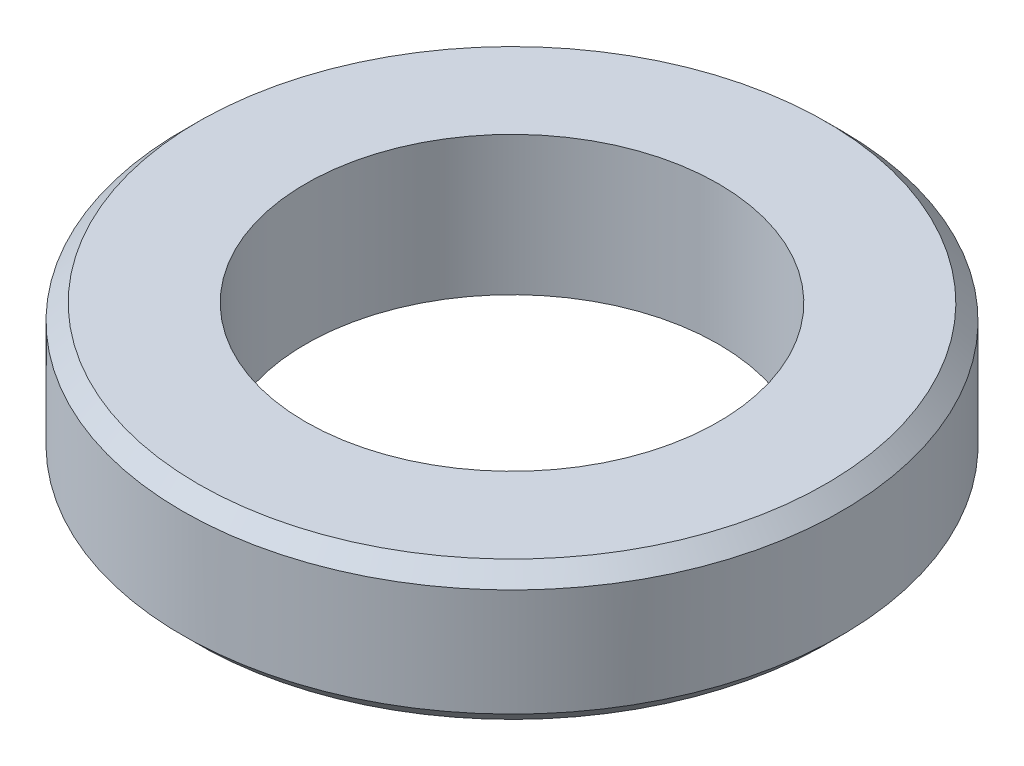
ISO-10303-21;
HEADER;
FILE_DESCRIPTION(('STEP AP214'),'2;1');
FILE_NAME('part.step','',(''),(''),'','','');
FILE_SCHEMA(('AUTOMOTIVE_DESIGN { 1 0 10303 214 1 1 1 1 }'));
ENDSEC;
DATA;
#1=APPLICATION_CONTEXT('core data for automotive mechanical design processes');
#2=APPLICATION_PROTOCOL_DEFINITION('international standard','automotive_design',2000,#1);
#3=PRODUCT_CONTEXT('',#1,'mechanical');
#4=PRODUCT('Part','Part','',(#3));
#5=PRODUCT_RELATED_PRODUCT_CATEGORY('part','',(#4));
#6=PRODUCT_DEFINITION_FORMATION('','',#4);
#7=PRODUCT_DEFINITION_CONTEXT('part definition',#1,'design');
#8=PRODUCT_DEFINITION('design','',#6,#7);
#9=PRODUCT_DEFINITION_SHAPE('','',#8);
#10=(LENGTH_UNIT() NAMED_UNIT(*) SI_UNIT(.MILLI.,.METRE.));
#11=(NAMED_UNIT(*) PLANE_ANGLE_UNIT() SI_UNIT($,.RADIAN.));
#12=(NAMED_UNIT(*) SI_UNIT($,.STERADIAN.) SOLID_ANGLE_UNIT());
#13=UNCERTAINTY_MEASURE_WITH_UNIT(LENGTH_MEASURE(1.E-05),#10,'distance_accuracy_value','');
#14=(GEOMETRIC_REPRESENTATION_CONTEXT(3) GLOBAL_UNCERTAINTY_ASSIGNED_CONTEXT((#13)) GLOBAL_UNIT_ASSIGNED_CONTEXT((#10,
#11,#12)) REPRESENTATION_CONTEXT('',''));
#15=CARTESIAN_POINT('',(0.,0.,0.));
#16=DIRECTION('',(0.,0.,1.));
#17=DIRECTION('',(1.,0.,0.));
#18=AXIS2_PLACEMENT_3D('',#15,#16,#17);
#19=CARTESIAN_POINT('',(0.,0.,0.));
#20=DIRECTION('',(0.,-1.,0.));
#21=DIRECTION('',(0.,0.,-1.));
#22=AXIS2_PLACEMENT_3D('',#19,#20,#21);
#23=CYLINDRICAL_SURFACE('',#22,10.668);
#24=CARTESIAN_POINT('',(0.,-3.98779999999999,0.));
#25=DIRECTION('',(0.,-1.,0.));
#26=DIRECTION('',(0.,0.,-1.));
#27=AXIS2_PLACEMENT_3D('',#24,#25,#26);
#28=CIRCLE('',#27,10.668);
#29=CARTESIAN_POINT('',(0.,-3.98779999999999,-10.668));
#30=VERTEX_POINT('',#29);
#31=EDGE_CURVE('E39',#30,#30,#28,.F.);
#32=ORIENTED_EDGE('',*,*,#31,.T.);
#33=EDGE_LOOP('',(#32));
#34=FACE_BOUND('',#33,.T.);
#35=CARTESIAN_POINT('',(0.,-0.508,0.));
#36=DIRECTION('',(0.,1.,0.));
#37=DIRECTION('',(0.,0.,1.));
#38=AXIS2_PLACEMENT_3D('',#35,#36,#37);
#39=CIRCLE('',#38,10.668);
#40=CARTESIAN_POINT('',(0.,-0.508,10.668));
#41=VERTEX_POINT('',#40);
#42=EDGE_CURVE('E43',#41,#41,#39,.F.);
#43=ORIENTED_EDGE('',*,*,#42,.T.);
#44=EDGE_LOOP('',(#43));
#45=FACE_BOUND('',#44,.T.);
#46=ADVANCED_FACE('F32',(#34,#45),#23,.T.);
#47=CARTESIAN_POINT('',(10.668,0.,0.));
#48=DIRECTION('',(0.,1.,0.));
#49=DIRECTION('',(0.,0.,1.));
#50=AXIS2_PLACEMENT_3D('',#47,#48,#49);
#51=PLANE('',#50);
#52=CARTESIAN_POINT('',(0.,0.,0.));
#53=DIRECTION('',(0.,1.,0.));
#54=DIRECTION('',(0.,0.,1.));
#55=AXIS2_PLACEMENT_3D('',#52,#53,#54);
#56=CIRCLE('',#55,10.16);
#57=CARTESIAN_POINT('',(0.,0.,10.16));
#58=VERTEX_POINT('',#57);
#59=EDGE_CURVE('E10',#58,#58,#56,.T.);
#60=ORIENTED_EDGE('',*,*,#59,.T.);
#61=EDGE_LOOP('',(#60));
#62=FACE_BOUND('',#61,.T.);
#63=CARTESIAN_POINT('',(0.,0.,0.));
#64=DIRECTION('',(0.,-1.,0.));
#65=DIRECTION('',(0.,0.,-1.));
#66=AXIS2_PLACEMENT_3D('',#63,#64,#65);
#67=CIRCLE('',#66,6.6802);
#68=CARTESIAN_POINT('',(0.,0.,-6.6802));
#69=VERTEX_POINT('',#68);
#70=EDGE_CURVE('E52',#69,#69,#67,.T.);
#71=ORIENTED_EDGE('',*,*,#70,.T.);
#72=EDGE_LOOP('',(#71));
#73=FACE_BOUND('',#72,.T.);
#74=ADVANCED_FACE('F72',(#62,#73),#51,.T.);
#75=CARTESIAN_POINT('',(0.,0.,0.));
#76=DIRECTION('',(0.,-1.,0.));
#77=DIRECTION('',(0.,0.,-1.));
#78=AXIS2_PLACEMENT_3D('',#75,#76,#77);
#79=CYLINDRICAL_SURFACE('',#78,6.6802);
#80=CARTESIAN_POINT('',(0.,-4.4958,0.));
#81=DIRECTION('',(0.,-1.,0.));
#82=DIRECTION('',(0.,0.,-1.));
#83=AXIS2_PLACEMENT_3D('',#80,#81,#82);
#84=CIRCLE('',#83,6.6802);
#85=CARTESIAN_POINT('',(0.,-4.4958,-6.6802));
#86=VERTEX_POINT('',#85);
#87=EDGE_CURVE('E55',#86,#86,#84,.T.);
#88=ORIENTED_EDGE('',*,*,#87,.T.);
#89=EDGE_LOOP('',(#88));
#90=FACE_BOUND('',#89,.T.);
#91=ORIENTED_EDGE('',*,*,#70,.F.);
#92=EDGE_LOOP('',(#91));
#93=FACE_BOUND('',#92,.T.);
#94=ADVANCED_FACE('F59',(#90,#93),#79,.F.);
#95=CARTESIAN_POINT('',(6.6802,-4.4958,0.));
#96=DIRECTION('',(0.,-1.,0.));
#97=DIRECTION('',(0.,0.,-1.));
#98=AXIS2_PLACEMENT_3D('',#95,#96,#97);
#99=PLANE('',#98);
#100=CARTESIAN_POINT('',(0.,-4.4958,0.));
#101=DIRECTION('',(0.,-1.,0.));
#102=DIRECTION('',(0.,0.,-1.));
#103=AXIS2_PLACEMENT_3D('',#100,#101,#102);
#104=CIRCLE('',#103,10.16);
#105=CARTESIAN_POINT('',(0.,-4.4958,-10.16));
#106=VERTEX_POINT('',#105);
#107=EDGE_CURVE('E47',#106,#106,#104,.T.);
#108=ORIENTED_EDGE('',*,*,#107,.T.);
#109=EDGE_LOOP('',(#108));
#110=FACE_BOUND('',#109,.T.);
#111=ORIENTED_EDGE('',*,*,#87,.F.);
#112=EDGE_LOOP('',(#111));
#113=FACE_BOUND('',#112,.T.);
#114=ADVANCED_FACE('F62',(#110,#113),#99,.T.);
#115=CARTESIAN_POINT('',(0.,-4.4958,0.));
#116=DIRECTION('',(0.,1.,0.));
#117=DIRECTION('',(0.,0.,1.));
#118=AXIS2_PLACEMENT_3D('',#115,#116,#117);
#119=CONICAL_SURFACE('',#118,10.16,0.785398163397445);
#120=ORIENTED_EDGE('',*,*,#31,.F.);
#121=EDGE_LOOP('',(#120));
#122=FACE_BOUND('',#121,.T.);
#123=ORIENTED_EDGE('',*,*,#107,.F.);
#124=EDGE_LOOP('',(#123));
#125=FACE_BOUND('',#124,.T.);
#126=ADVANCED_FACE('F64',(#122,#125),#119,.T.);
#127=CARTESIAN_POINT('',(0.,-0.508,0.));
#128=DIRECTION('',(0.,-1.,0.));
#129=DIRECTION('',(0.,0.,-1.));
#130=AXIS2_PLACEMENT_3D('',#127,#128,#129);
#131=CONICAL_SURFACE('',#130,10.668,0.785398163397448);
#132=ORIENTED_EDGE('',*,*,#59,.F.);
#133=EDGE_LOOP('',(#132));
#134=FACE_BOUND('',#133,.T.);
#135=ORIENTED_EDGE('',*,*,#42,.F.);
#136=EDGE_LOOP('',(#135));
#137=FACE_BOUND('',#136,.T.);
#138=ADVANCED_FACE('F34',(#134,#137),#131,.T.);
#139=CLOSED_SHELL('',(#46,#74,#94,#114,#126,#138));
#140=MANIFOLD_SOLID_BREP('B2',#139);
#141=ADVANCED_BREP_SHAPE_REPRESENTATION('',(#18,#140),#14);
#142=SHAPE_DEFINITION_REPRESENTATION(#9,#141);
ENDSEC;
END-ISO-10303-21;
